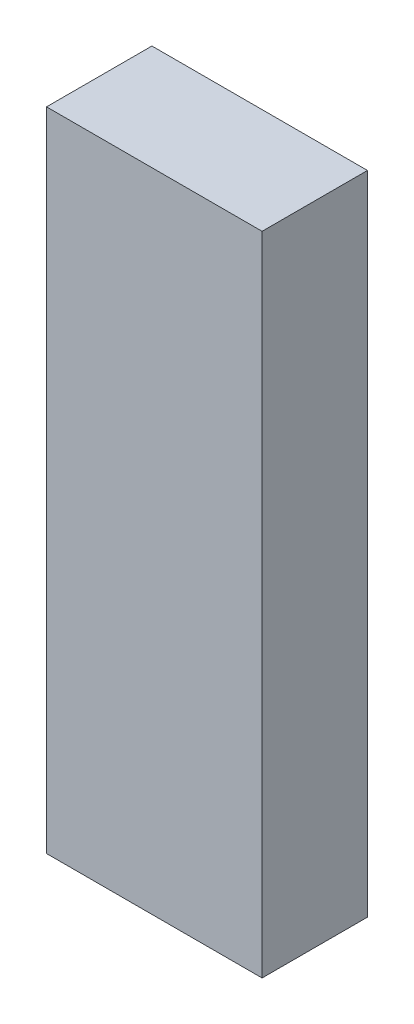
ISO-10303-21;
HEADER;
FILE_DESCRIPTION(('STEP AP214'),'2;1');
FILE_NAME('part.step','',(''),(''),'','','');
FILE_SCHEMA(('AUTOMOTIVE_DESIGN { 1 0 10303 214 1 1 1 1 }'));
ENDSEC;
DATA;
#1=APPLICATION_CONTEXT('core data for automotive mechanical design processes');
#2=APPLICATION_PROTOCOL_DEFINITION('international standard','automotive_design',2000,#1);
#3=PRODUCT_CONTEXT('',#1,'mechanical');
#4=PRODUCT('Part','Part','',(#3));
#5=PRODUCT_RELATED_PRODUCT_CATEGORY('part','',(#4));
#6=PRODUCT_DEFINITION_FORMATION('','',#4);
#7=PRODUCT_DEFINITION_CONTEXT('part definition',#1,'design');
#8=PRODUCT_DEFINITION('design','',#6,#7);
#9=PRODUCT_DEFINITION_SHAPE('','',#8);
#10=(LENGTH_UNIT() NAMED_UNIT(*) SI_UNIT(.MILLI.,.METRE.));
#11=(NAMED_UNIT(*) PLANE_ANGLE_UNIT() SI_UNIT($,.RADIAN.));
#12=(NAMED_UNIT(*) SI_UNIT($,.STERADIAN.) SOLID_ANGLE_UNIT());
#13=UNCERTAINTY_MEASURE_WITH_UNIT(LENGTH_MEASURE(1.E-05),#10,'distance_accuracy_value','');
#14=(GEOMETRIC_REPRESENTATION_CONTEXT(3) GLOBAL_UNCERTAINTY_ASSIGNED_CONTEXT((#13)) GLOBAL_UNIT_ASSIGNED_CONTEXT((#10,
#11,#12)) REPRESENTATION_CONTEXT('',''));
#15=CARTESIAN_POINT('',(0.,0.,0.));
#16=DIRECTION('',(0.,0.,1.));
#17=DIRECTION('',(1.,0.,0.));
#18=AXIS2_PLACEMENT_3D('',#15,#16,#17);
#19=CARTESIAN_POINT('',(22.5,67.5,11.));
#20=DIRECTION('',(-1.,0.,0.));
#21=DIRECTION('',(0.,0.,1.));
#22=AXIS2_PLACEMENT_3D('',#19,#20,#21);
#23=PLANE('',#22);
#24=DIRECTION('',(0.,0.,-1.));
#25=VECTOR('',#24,1.);
#26=CARTESIAN_POINT('',(22.5,-67.5,11.));
#27=LINE('',#26,#25);
#28=CARTESIAN_POINT('',(22.5,-67.5,11.));
#29=VERTEX_POINT('',#28);
#30=CARTESIAN_POINT('',(22.5,-67.5,-11.));
#31=VERTEX_POINT('',#30);
#32=EDGE_CURVE('E93',#29,#31,#27,.T.);
#33=ORIENTED_EDGE('',*,*,#32,.T.);
#34=DIRECTION('',(0.,-1.,0.));
#35=VECTOR('',#34,1.);
#36=CARTESIAN_POINT('',(22.5,67.5,-11.));
#37=LINE('',#36,#35);
#38=CARTESIAN_POINT('',(22.5,67.5,-11.));
#39=VERTEX_POINT('',#38);
#40=EDGE_CURVE('E11',#39,#31,#37,.T.);
#41=ORIENTED_EDGE('',*,*,#40,.F.);
#42=DIRECTION('',(0.,0.,-1.));
#43=VECTOR('',#42,1.);
#44=CARTESIAN_POINT('',(22.5,67.5,11.));
#45=LINE('',#44,#43);
#46=CARTESIAN_POINT('',(22.5,67.5,11.));
#47=VERTEX_POINT('',#46);
#48=EDGE_CURVE('E81',#47,#39,#45,.T.);
#49=ORIENTED_EDGE('',*,*,#48,.F.);
#50=DIRECTION('',(0.,-1.,0.));
#51=VECTOR('',#50,1.);
#52=CARTESIAN_POINT('',(22.5,67.5,11.));
#53=LINE('',#52,#51);
#54=EDGE_CURVE('E89',#47,#29,#53,.T.);
#55=ORIENTED_EDGE('',*,*,#54,.T.);
#56=EDGE_LOOP('',(#33,#41,#49,#55));
#57=FACE_BOUND('',#56,.T.);
#58=ADVANCED_FACE('F30',(#57),#23,.F.);
#59=CARTESIAN_POINT('',(-22.5,67.5,-11.));
#60=DIRECTION('',(0.,0.,1.));
#61=DIRECTION('',(1.,0.,0.));
#62=AXIS2_PLACEMENT_3D('',#59,#60,#61);
#63=PLANE('',#62);
#64=DIRECTION('',(-1.,0.,0.));
#65=VECTOR('',#64,1.);
#66=CARTESIAN_POINT('',(-22.5,-67.5,-11.));
#67=LINE('',#66,#65);
#68=CARTESIAN_POINT('',(-22.5,-67.5,-11.));
#69=VERTEX_POINT('',#68);
#70=EDGE_CURVE('E85',#31,#69,#67,.T.);
#71=ORIENTED_EDGE('',*,*,#70,.T.);
#72=DIRECTION('',(0.,-1.,0.));
#73=VECTOR('',#72,1.);
#74=CARTESIAN_POINT('',(-22.5,67.5,-11.));
#75=LINE('',#74,#73);
#76=CARTESIAN_POINT('',(-22.5,67.5,-11.));
#77=VERTEX_POINT('',#76);
#78=EDGE_CURVE('E38',#77,#69,#75,.T.);
#79=ORIENTED_EDGE('',*,*,#78,.F.);
#80=DIRECTION('',(-1.,0.,0.));
#81=VECTOR('',#80,1.);
#82=CARTESIAN_POINT('',(-22.5,67.5,-11.));
#83=LINE('',#82,#81);
#84=EDGE_CURVE('E76',#39,#77,#83,.T.);
#85=ORIENTED_EDGE('',*,*,#84,.F.);
#86=ORIENTED_EDGE('',*,*,#40,.T.);
#87=EDGE_LOOP('',(#71,#79,#85,#86));
#88=FACE_BOUND('',#87,.T.);
#89=ADVANCED_FACE('F84',(#88),#63,.F.);
#90=CARTESIAN_POINT('',(-22.5,67.5,11.));
#91=DIRECTION('',(1.,0.,0.));
#92=DIRECTION('',(0.,0.,-1.));
#93=AXIS2_PLACEMENT_3D('',#90,#91,#92);
#94=PLANE('',#93);
#95=DIRECTION('',(0.,0.,1.));
#96=VECTOR('',#95,1.);
#97=CARTESIAN_POINT('',(-22.5,-67.5,11.));
#98=LINE('',#97,#96);
#99=CARTESIAN_POINT('',(-22.5,-67.5,11.));
#100=VERTEX_POINT('',#99);
#101=EDGE_CURVE('E63',#69,#100,#98,.T.);
#102=ORIENTED_EDGE('',*,*,#101,.T.);
#103=DIRECTION('',(0.,-1.,0.));
#104=VECTOR('',#103,1.);
#105=CARTESIAN_POINT('',(-22.5,67.5,11.));
#106=LINE('',#105,#104);
#107=CARTESIAN_POINT('',(-22.5,67.5,11.));
#108=VERTEX_POINT('',#107);
#109=EDGE_CURVE('E86',#108,#100,#106,.T.);
#110=ORIENTED_EDGE('',*,*,#109,.F.);
#111=DIRECTION('',(0.,0.,1.));
#112=VECTOR('',#111,1.);
#113=CARTESIAN_POINT('',(-22.5,67.5,11.));
#114=LINE('',#113,#112);
#115=EDGE_CURVE('E79',#77,#108,#114,.T.);
#116=ORIENTED_EDGE('',*,*,#115,.F.);
#117=ORIENTED_EDGE('',*,*,#78,.T.);
#118=EDGE_LOOP('',(#102,#110,#116,#117));
#119=FACE_BOUND('',#118,.T.);
#120=ADVANCED_FACE('F87',(#119),#94,.F.);
#121=CARTESIAN_POINT('',(-22.5,67.5,11.));
#122=DIRECTION('',(0.,0.,-1.));
#123=DIRECTION('',(-1.,0.,0.));
#124=AXIS2_PLACEMENT_3D('',#121,#122,#123);
#125=PLANE('',#124);
#126=DIRECTION('',(1.,0.,0.));
#127=VECTOR('',#126,1.);
#128=CARTESIAN_POINT('',(-22.5,-67.5,11.));
#129=LINE('',#128,#127);
#130=EDGE_CURVE('E69',#100,#29,#129,.T.);
#131=ORIENTED_EDGE('',*,*,#130,.T.);
#132=ORIENTED_EDGE('',*,*,#54,.F.);
#133=DIRECTION('',(1.,0.,0.));
#134=VECTOR('',#133,1.);
#135=CARTESIAN_POINT('',(-22.5,67.5,11.));
#136=LINE('',#135,#134);
#137=EDGE_CURVE('E46',#108,#47,#136,.T.);
#138=ORIENTED_EDGE('',*,*,#137,.F.);
#139=ORIENTED_EDGE('',*,*,#109,.T.);
#140=EDGE_LOOP('',(#131,#132,#138,#139));
#141=FACE_BOUND('',#140,.T.);
#142=ADVANCED_FACE('F100',(#141),#125,.F.);
#143=CARTESIAN_POINT('',(0.,67.5,0.));
#144=DIRECTION('',(0.,-1.,0.));
#145=DIRECTION('',(0.,0.,-1.));
#146=AXIS2_PLACEMENT_3D('',#143,#144,#145);
#147=PLANE('',#146);
#148=ORIENTED_EDGE('',*,*,#48,.T.);
#149=ORIENTED_EDGE('',*,*,#84,.T.);
#150=ORIENTED_EDGE('',*,*,#115,.T.);
#151=ORIENTED_EDGE('',*,*,#137,.T.);
#152=EDGE_LOOP('',(#148,#149,#150,#151));
#153=FACE_BOUND('',#152,.T.);
#154=ADVANCED_FACE('F77',(#153),#147,.F.);
#155=CARTESIAN_POINT('',(0.,-67.5,0.));
#156=DIRECTION('',(0.,-1.,0.));
#157=DIRECTION('',(0.,0.,-1.));
#158=AXIS2_PLACEMENT_3D('',#155,#156,#157);
#159=PLANE('',#158);
#160=ORIENTED_EDGE('',*,*,#32,.F.);
#161=ORIENTED_EDGE('',*,*,#130,.F.);
#162=ORIENTED_EDGE('',*,*,#101,.F.);
#163=ORIENTED_EDGE('',*,*,#70,.F.);
#164=EDGE_LOOP('',(#160,#161,#162,#163));
#165=FACE_BOUND('',#164,.T.);
#166=ADVANCED_FACE('F103',(#165),#159,.T.);
#167=CLOSED_SHELL('',(#58,#89,#120,#142,#154,#166));
#168=MANIFOLD_SOLID_BREP('B2',#167);
#169=ADVANCED_BREP_SHAPE_REPRESENTATION('',(#18,#168),#14);
#170=SHAPE_DEFINITION_REPRESENTATION(#9,#169);
ENDSEC;
END-ISO-10303-21;
